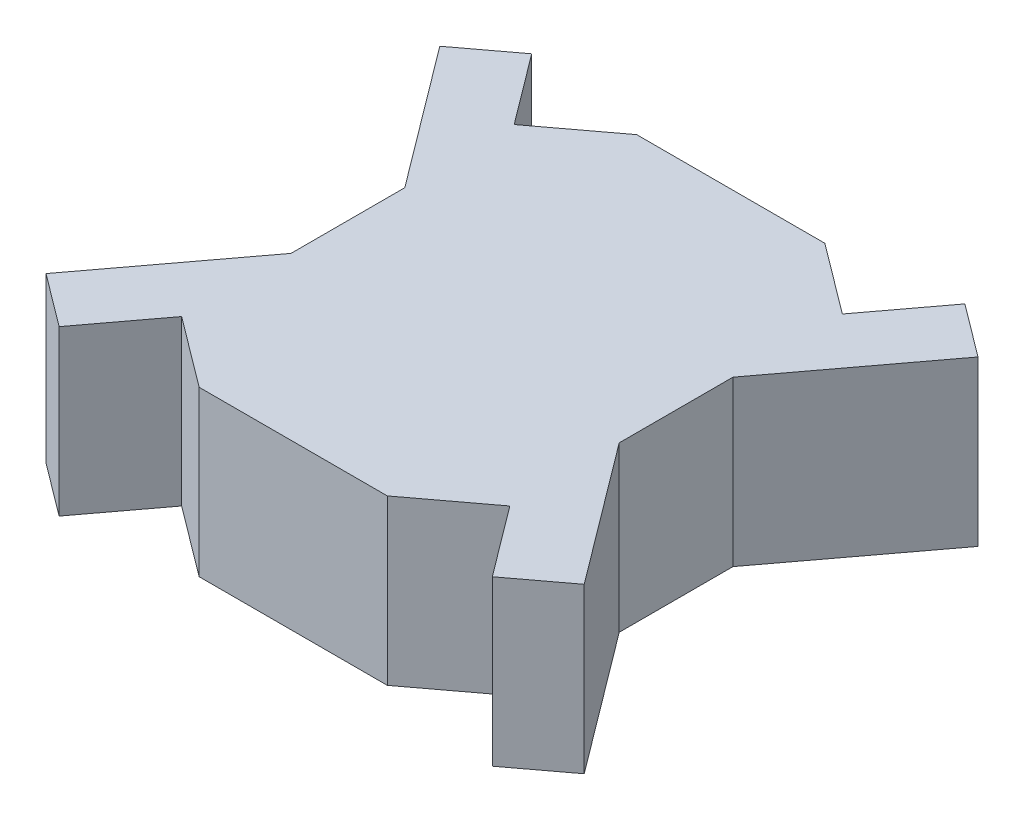
ISO-10303-21;
HEADER;
FILE_DESCRIPTION(('STEP AP214'),'2;1');
FILE_NAME('part.step','',(''),(''),'','','');
FILE_SCHEMA(('AUTOMOTIVE_DESIGN { 1 0 10303 214 1 1 1 1 }'));
ENDSEC;
DATA;
#1=APPLICATION_CONTEXT('core data for automotive mechanical design processes');
#2=APPLICATION_PROTOCOL_DEFINITION('international standard','automotive_design',2000,#1);
#3=PRODUCT_CONTEXT('',#1,'mechanical');
#4=PRODUCT('Part','Part','',(#3));
#5=PRODUCT_RELATED_PRODUCT_CATEGORY('part','',(#4));
#6=PRODUCT_DEFINITION_FORMATION('','',#4);
#7=PRODUCT_DEFINITION_CONTEXT('part definition',#1,'design');
#8=PRODUCT_DEFINITION('design','',#6,#7);
#9=PRODUCT_DEFINITION_SHAPE('','',#8);
#10=(LENGTH_UNIT() NAMED_UNIT(*) SI_UNIT(.MILLI.,.METRE.));
#11=(NAMED_UNIT(*) PLANE_ANGLE_UNIT() SI_UNIT($,.RADIAN.));
#12=(NAMED_UNIT(*) SI_UNIT($,.STERADIAN.) SOLID_ANGLE_UNIT());
#13=UNCERTAINTY_MEASURE_WITH_UNIT(LENGTH_MEASURE(1.E-05),#10,'distance_accuracy_value','');
#14=(GEOMETRIC_REPRESENTATION_CONTEXT(3) GLOBAL_UNCERTAINTY_ASSIGNED_CONTEXT((#13)) GLOBAL_UNIT_ASSIGNED_CONTEXT((#10,
#11,#12)) REPRESENTATION_CONTEXT('',''));
#15=CARTESIAN_POINT('',(0.,0.,0.));
#16=DIRECTION('',(0.,0.,1.));
#17=DIRECTION('',(1.,0.,0.));
#18=AXIS2_PLACEMENT_3D('',#15,#16,#17);
#19=CARTESIAN_POINT('',(43.,75.,-100.));
#20=DIRECTION('',(0.6,0.,-0.8));
#21=DIRECTION('',(-0.8,0.,-0.6));
#22=AXIS2_PLACEMENT_3D('',#19,#20,#21);
#23=PLANE('',#22);
#24=DIRECTION('',(0.8,0.,0.6));
#25=VECTOR('',#24,1.);
#26=CARTESIAN_POINT('',(43.,0.,-100.));
#27=LINE('',#26,#25);
#28=CARTESIAN_POINT('',(43.,0.,-100.));
#29=VERTEX_POINT('',#28);
#30=CARTESIAN_POINT('',(75.,0.,-76.));
#31=VERTEX_POINT('',#30);
#32=EDGE_CURVE('E207',#29,#31,#27,.T.);
#33=ORIENTED_EDGE('',*,*,#32,.F.);
#34=DIRECTION('',(0.,-1.,0.));
#35=VECTOR('',#34,1.);
#36=CARTESIAN_POINT('',(43.,75.,-100.));
#37=LINE('',#36,#35);
#38=CARTESIAN_POINT('',(43.,75.,-100.));
#39=VERTEX_POINT('',#38);
#40=EDGE_CURVE('E11',#39,#29,#37,.T.);
#41=ORIENTED_EDGE('',*,*,#40,.F.);
#42=DIRECTION('',(0.8,0.,0.6));
#43=VECTOR('',#42,1.);
#44=CARTESIAN_POINT('',(43.,75.,-100.));
#45=LINE('',#44,#43);
#46=CARTESIAN_POINT('',(75.,75.,-76.));
#47=VERTEX_POINT('',#46);
#48=EDGE_CURVE('E256',#39,#47,#45,.T.);
#49=ORIENTED_EDGE('',*,*,#48,.T.);
#50=DIRECTION('',(0.,-1.,0.));
#51=VECTOR('',#50,1.);
#52=CARTESIAN_POINT('',(75.,75.,-76.));
#53=LINE('',#52,#51);
#54=EDGE_CURVE('E40',#47,#31,#53,.T.);
#55=ORIENTED_EDGE('',*,*,#54,.T.);
#56=EDGE_LOOP('',(#33,#41,#49,#55));
#57=FACE_BOUND('',#56,.T.);
#58=ADVANCED_FACE('F37',(#57),#23,.T.);
#59=CARTESIAN_POINT('',(43.,75.,-100.));
#60=DIRECTION('',(0.,0.,1.));
#61=DIRECTION('',(1.,0.,0.));
#62=AXIS2_PLACEMENT_3D('',#59,#60,#61);
#63=PLANE('',#62);
#64=DIRECTION('',(-1.,0.,0.));
#65=VECTOR('',#64,1.);
#66=CARTESIAN_POINT('',(43.,0.,-100.));
#67=LINE('',#66,#65);
#68=CARTESIAN_POINT('',(-43.,0.,-100.));
#69=VERTEX_POINT('',#68);
#70=EDGE_CURVE('E118',#29,#69,#67,.T.);
#71=ORIENTED_EDGE('',*,*,#70,.T.);
#72=DIRECTION('',(0.,-1.,0.));
#73=VECTOR('',#72,1.);
#74=CARTESIAN_POINT('',(-43.,75.,-100.));
#75=LINE('',#74,#73);
#76=CARTESIAN_POINT('',(-43.,75.,-100.));
#77=VERTEX_POINT('',#76);
#78=EDGE_CURVE('E46',#77,#69,#75,.T.);
#79=ORIENTED_EDGE('',*,*,#78,.F.);
#80=DIRECTION('',(-1.,0.,0.));
#81=VECTOR('',#80,1.);
#82=CARTESIAN_POINT('',(43.,75.,-100.));
#83=LINE('',#82,#81);
#84=EDGE_CURVE('E185',#39,#77,#83,.T.);
#85=ORIENTED_EDGE('',*,*,#84,.F.);
#86=ORIENTED_EDGE('',*,*,#40,.T.);
#87=EDGE_LOOP('',(#71,#79,#85,#86));
#88=FACE_BOUND('',#87,.T.);
#89=ADVANCED_FACE('F408',(#88),#63,.F.);
#90=CARTESIAN_POINT('',(-43.,75.,-100.));
#91=DIRECTION('',(0.6,0.,0.8));
#92=DIRECTION('',(0.8,0.,-0.6));
#93=AXIS2_PLACEMENT_3D('',#90,#91,#92);
#94=PLANE('',#93);
#95=DIRECTION('',(-0.8,0.,0.6));
#96=VECTOR('',#95,1.);
#97=CARTESIAN_POINT('',(-43.,0.,-100.));
#98=LINE('',#97,#96);
#99=CARTESIAN_POINT('',(-75.,0.,-76.));
#100=VERTEX_POINT('',#99);
#101=EDGE_CURVE('E192',#69,#100,#98,.T.);
#102=ORIENTED_EDGE('',*,*,#101,.T.);
#103=DIRECTION('',(0.,-1.,0.));
#104=VECTOR('',#103,1.);
#105=CARTESIAN_POINT('',(-75.,75.,-76.));
#106=LINE('',#105,#104);
#107=CARTESIAN_POINT('',(-75.,75.,-76.));
#108=VERTEX_POINT('',#107);
#109=EDGE_CURVE('E189',#108,#100,#106,.T.);
#110=ORIENTED_EDGE('',*,*,#109,.F.);
#111=DIRECTION('',(-0.8,0.,0.6));
#112=VECTOR('',#111,1.);
#113=CARTESIAN_POINT('',(-43.,75.,-100.));
#114=LINE('',#113,#112);
#115=EDGE_CURVE('E178',#77,#108,#114,.T.);
#116=ORIENTED_EDGE('',*,*,#115,.F.);
#117=ORIENTED_EDGE('',*,*,#78,.T.);
#118=EDGE_LOOP('',(#102,#110,#116,#117));
#119=FACE_BOUND('',#118,.T.);
#120=ADVANCED_FACE('F190',(#119),#94,.F.);
#121=CARTESIAN_POINT('',(-75.,75.,-76.));
#122=DIRECTION('',(-0.8,0.,0.6));
#123=DIRECTION('',(0.6,0.,0.8));
#124=AXIS2_PLACEMENT_3D('',#121,#122,#123);
#125=PLANE('',#124);
#126=DIRECTION('',(-0.6,0.,-0.8));
#127=VECTOR('',#126,1.);
#128=CARTESIAN_POINT('',(-75.,0.,-76.));
#129=LINE('',#128,#127);
#130=CARTESIAN_POINT('',(-99.,0.,-108.));
#131=VERTEX_POINT('',#130);
#132=EDGE_CURVE('E253',#100,#131,#129,.T.);
#133=ORIENTED_EDGE('',*,*,#132,.T.);
#134=DIRECTION('',(0.,-1.,0.));
#135=VECTOR('',#134,1.);
#136=CARTESIAN_POINT('',(-99.,75.,-108.));
#137=LINE('',#136,#135);
#138=CARTESIAN_POINT('',(-99.,75.,-108.));
#139=VERTEX_POINT('',#138);
#140=EDGE_CURVE('E195',#139,#131,#137,.T.);
#141=ORIENTED_EDGE('',*,*,#140,.F.);
#142=DIRECTION('',(-0.6,0.,-0.8));
#143=VECTOR('',#142,1.);
#144=CARTESIAN_POINT('',(-75.,75.,-76.));
#145=LINE('',#144,#143);
#146=EDGE_CURVE('E183',#108,#139,#145,.T.);
#147=ORIENTED_EDGE('',*,*,#146,.F.);
#148=ORIENTED_EDGE('',*,*,#109,.T.);
#149=EDGE_LOOP('',(#133,#141,#147,#148));
#150=FACE_BOUND('',#149,.T.);
#151=ADVANCED_FACE('F197',(#150),#125,.F.);
#152=CARTESIAN_POINT('',(-99.,75.,-108.));
#153=DIRECTION('',(0.6,0.,0.8));
#154=DIRECTION('',(0.8,0.,-0.6));
#155=AXIS2_PLACEMENT_3D('',#152,#153,#154);
#156=PLANE('',#155);
#157=DIRECTION('',(-0.8,0.,0.6));
#158=VECTOR('',#157,1.);
#159=CARTESIAN_POINT('',(-99.,0.,-108.));
#160=LINE('',#159,#158);
#161=CARTESIAN_POINT('',(-123.,0.,-90.));
#162=VERTEX_POINT('',#161);
#163=EDGE_CURVE('E251',#131,#162,#160,.T.);
#164=ORIENTED_EDGE('',*,*,#163,.T.);
#165=DIRECTION('',(0.,-1.,0.));
#166=VECTOR('',#165,1.);
#167=CARTESIAN_POINT('',(-123.,75.,-90.));
#168=LINE('',#167,#166);
#169=CARTESIAN_POINT('',(-123.,75.,-90.));
#170=VERTEX_POINT('',#169);
#171=EDGE_CURVE('E260',#170,#162,#168,.T.);
#172=ORIENTED_EDGE('',*,*,#171,.F.);
#173=DIRECTION('',(-0.8,0.,0.6));
#174=VECTOR('',#173,1.);
#175=CARTESIAN_POINT('',(-99.,75.,-108.));
#176=LINE('',#175,#174);
#177=EDGE_CURVE('E200',#139,#170,#176,.T.);
#178=ORIENTED_EDGE('',*,*,#177,.F.);
#179=ORIENTED_EDGE('',*,*,#140,.T.);
#180=EDGE_LOOP('',(#164,#172,#178,#179));
#181=FACE_BOUND('',#180,.T.);
#182=ADVANCED_FACE('F300',(#181),#156,.F.);
#183=CARTESIAN_POINT('',(-123.,75.,-90.));
#184=DIRECTION('',(0.8,0.,-0.6));
#185=DIRECTION('',(-0.6,0.,-0.8));
#186=AXIS2_PLACEMENT_3D('',#183,#184,#185);
#187=PLANE('',#186);
#188=DIRECTION('',(0.6,0.,0.8));
#189=VECTOR('',#188,1.);
#190=CARTESIAN_POINT('',(-123.,0.,-90.));
#191=LINE('',#190,#189);
#192=CARTESIAN_POINT('',(-75.,0.,-26.));
#193=VERTEX_POINT('',#192);
#194=EDGE_CURVE('E249',#162,#193,#191,.T.);
#195=ORIENTED_EDGE('',*,*,#194,.T.);
#196=DIRECTION('',(0.,-1.,0.));
#197=VECTOR('',#196,1.);
#198=CARTESIAN_POINT('',(-75.,75.,-26.));
#199=LINE('',#198,#197);
#200=CARTESIAN_POINT('',(-75.,75.,-26.));
#201=VERTEX_POINT('',#200);
#202=EDGE_CURVE('E263',#201,#193,#199,.T.);
#203=ORIENTED_EDGE('',*,*,#202,.F.);
#204=DIRECTION('',(0.6,0.,0.8));
#205=VECTOR('',#204,1.);
#206=CARTESIAN_POINT('',(-123.,75.,-90.));
#207=LINE('',#206,#205);
#208=EDGE_CURVE('E202',#170,#201,#207,.T.);
#209=ORIENTED_EDGE('',*,*,#208,.F.);
#210=ORIENTED_EDGE('',*,*,#171,.T.);
#211=EDGE_LOOP('',(#195,#203,#209,#210));
#212=FACE_BOUND('',#211,.T.);
#213=ADVANCED_FACE('F309',(#212),#187,.F.);
#214=CARTESIAN_POINT('',(-75.,75.,-26.));
#215=DIRECTION('',(1.,0.,0.));
#216=DIRECTION('',(0.,0.,-1.));
#217=AXIS2_PLACEMENT_3D('',#214,#215,#216);
#218=PLANE('',#217);
#219=DIRECTION('',(0.,0.,1.));
#220=VECTOR('',#219,1.);
#221=CARTESIAN_POINT('',(-75.,0.,-26.));
#222=LINE('',#221,#220);
#223=CARTESIAN_POINT('',(-75.,0.,26.));
#224=VERTEX_POINT('',#223);
#225=EDGE_CURVE('E246',#193,#224,#222,.T.);
#226=ORIENTED_EDGE('',*,*,#225,.T.);
#227=DIRECTION('',(0.,-1.,0.));
#228=VECTOR('',#227,1.);
#229=CARTESIAN_POINT('',(-75.,75.,26.));
#230=LINE('',#229,#228);
#231=CARTESIAN_POINT('',(-75.,75.,26.));
#232=VERTEX_POINT('',#231);
#233=EDGE_CURVE('E266',#232,#224,#230,.T.);
#234=ORIENTED_EDGE('',*,*,#233,.F.);
#235=DIRECTION('',(0.,0.,1.));
#236=VECTOR('',#235,1.);
#237=CARTESIAN_POINT('',(-75.,75.,-26.));
#238=LINE('',#237,#236);
#239=EDGE_CURVE('E306',#201,#232,#238,.T.);
#240=ORIENTED_EDGE('',*,*,#239,.F.);
#241=ORIENTED_EDGE('',*,*,#202,.T.);
#242=EDGE_LOOP('',(#226,#234,#240,#241));
#243=FACE_BOUND('',#242,.T.);
#244=ADVANCED_FACE('F312',(#243),#218,.F.);
#245=CARTESIAN_POINT('',(-123.,75.,90.));
#246=DIRECTION('',(-0.8,0.,-0.6));
#247=DIRECTION('',(-0.6,0.,0.8));
#248=AXIS2_PLACEMENT_3D('',#245,#246,#247);
#249=PLANE('',#248);
#250=DIRECTION('',(0.6,0.,-0.8));
#251=VECTOR('',#250,1.);
#252=CARTESIAN_POINT('',(-123.,0.,90.));
#253=LINE('',#252,#251);
#254=CARTESIAN_POINT('',(-123.,0.,90.));
#255=VERTEX_POINT('',#254);
#256=EDGE_CURVE('E243',#255,#224,#253,.T.);
#257=ORIENTED_EDGE('',*,*,#256,.F.);
#258=DIRECTION('',(0.,-1.,0.));
#259=VECTOR('',#258,1.);
#260=CARTESIAN_POINT('',(-123.,75.,90.));
#261=LINE('',#260,#259);
#262=CARTESIAN_POINT('',(-123.,75.,90.));
#263=VERTEX_POINT('',#262);
#264=EDGE_CURVE('E268',#263,#255,#261,.T.);
#265=ORIENTED_EDGE('',*,*,#264,.F.);
#266=DIRECTION('',(0.6,0.,-0.8));
#267=VECTOR('',#266,1.);
#268=CARTESIAN_POINT('',(-123.,75.,90.));
#269=LINE('',#268,#267);
#270=EDGE_CURVE('E314',#263,#232,#269,.T.);
#271=ORIENTED_EDGE('',*,*,#270,.T.);
#272=ORIENTED_EDGE('',*,*,#233,.T.);
#273=EDGE_LOOP('',(#257,#265,#271,#272));
#274=FACE_BOUND('',#273,.T.);
#275=ADVANCED_FACE('F398',(#274),#249,.T.);
#276=CARTESIAN_POINT('',(-99.,75.,108.));
#277=DIRECTION('',(-0.6,0.,0.8));
#278=DIRECTION('',(0.8,0.,0.6));
#279=AXIS2_PLACEMENT_3D('',#276,#277,#278);
#280=PLANE('',#279);
#281=DIRECTION('',(-0.8,0.,-0.6));
#282=VECTOR('',#281,1.);
#283=CARTESIAN_POINT('',(-99.,0.,108.));
#284=LINE('',#283,#282);
#285=CARTESIAN_POINT('',(-99.,0.,108.));
#286=VERTEX_POINT('',#285);
#287=EDGE_CURVE('E240',#286,#255,#284,.T.);
#288=ORIENTED_EDGE('',*,*,#287,.F.);
#289=DIRECTION('',(0.,-1.,0.));
#290=VECTOR('',#289,1.);
#291=CARTESIAN_POINT('',(-99.,75.,108.));
#292=LINE('',#291,#290);
#293=CARTESIAN_POINT('',(-99.,75.,108.));
#294=VERTEX_POINT('',#293);
#295=EDGE_CURVE('E270',#294,#286,#292,.T.);
#296=ORIENTED_EDGE('',*,*,#295,.F.);
#297=DIRECTION('',(-0.8,0.,-0.6));
#298=VECTOR('',#297,1.);
#299=CARTESIAN_POINT('',(-99.,75.,108.));
#300=LINE('',#299,#298);
#301=EDGE_CURVE('E316',#294,#263,#300,.T.);
#302=ORIENTED_EDGE('',*,*,#301,.T.);
#303=ORIENTED_EDGE('',*,*,#264,.T.);
#304=EDGE_LOOP('',(#288,#296,#302,#303));
#305=FACE_BOUND('',#304,.T.);
#306=ADVANCED_FACE('F395',(#305),#280,.T.);
#307=CARTESIAN_POINT('',(-75.,75.,76.));
#308=DIRECTION('',(0.8,0.,0.6));
#309=DIRECTION('',(0.6,0.,-0.8));
#310=AXIS2_PLACEMENT_3D('',#307,#308,#309);
#311=PLANE('',#310);
#312=DIRECTION('',(-0.6,0.,0.8));
#313=VECTOR('',#312,1.);
#314=CARTESIAN_POINT('',(-75.,0.,76.));
#315=LINE('',#314,#313);
#316=CARTESIAN_POINT('',(-75.,0.,76.));
#317=VERTEX_POINT('',#316);
#318=EDGE_CURVE('E237',#317,#286,#315,.T.);
#319=ORIENTED_EDGE('',*,*,#318,.F.);
#320=DIRECTION('',(0.,-1.,0.));
#321=VECTOR('',#320,1.);
#322=CARTESIAN_POINT('',(-75.,75.,76.));
#323=LINE('',#322,#321);
#324=CARTESIAN_POINT('',(-75.,75.,76.));
#325=VERTEX_POINT('',#324);
#326=EDGE_CURVE('E272',#325,#317,#323,.T.);
#327=ORIENTED_EDGE('',*,*,#326,.F.);
#328=DIRECTION('',(-0.6,0.,0.8));
#329=VECTOR('',#328,1.);
#330=CARTESIAN_POINT('',(-75.,75.,76.));
#331=LINE('',#330,#329);
#332=EDGE_CURVE('E321',#325,#294,#331,.T.);
#333=ORIENTED_EDGE('',*,*,#332,.T.);
#334=ORIENTED_EDGE('',*,*,#295,.T.);
#335=EDGE_LOOP('',(#319,#327,#333,#334));
#336=FACE_BOUND('',#335,.T.);
#337=ADVANCED_FACE('F391',(#336),#311,.T.);
#338=CARTESIAN_POINT('',(-43.,75.,100.));
#339=DIRECTION('',(-0.6,0.,0.8));
#340=DIRECTION('',(0.8,0.,0.6));
#341=AXIS2_PLACEMENT_3D('',#338,#339,#340);
#342=PLANE('',#341);
#343=DIRECTION('',(-0.8,0.,-0.6));
#344=VECTOR('',#343,1.);
#345=CARTESIAN_POINT('',(-43.,0.,100.));
#346=LINE('',#345,#344);
#347=CARTESIAN_POINT('',(-43.,0.,100.));
#348=VERTEX_POINT('',#347);
#349=EDGE_CURVE('E234',#348,#317,#346,.T.);
#350=ORIENTED_EDGE('',*,*,#349,.F.);
#351=DIRECTION('',(0.,-1.,0.));
#352=VECTOR('',#351,1.);
#353=CARTESIAN_POINT('',(-43.,75.,100.));
#354=LINE('',#353,#352);
#355=CARTESIAN_POINT('',(-43.,75.,100.));
#356=VERTEX_POINT('',#355);
#357=EDGE_CURVE('E274',#356,#348,#354,.T.);
#358=ORIENTED_EDGE('',*,*,#357,.F.);
#359=DIRECTION('',(-0.8,0.,-0.6));
#360=VECTOR('',#359,1.);
#361=CARTESIAN_POINT('',(-43.,75.,100.));
#362=LINE('',#361,#360);
#363=EDGE_CURVE('E324',#356,#325,#362,.T.);
#364=ORIENTED_EDGE('',*,*,#363,.T.);
#365=ORIENTED_EDGE('',*,*,#326,.T.);
#366=EDGE_LOOP('',(#350,#358,#364,#365));
#367=FACE_BOUND('',#366,.T.);
#368=ADVANCED_FACE('F387',(#367),#342,.T.);
#369=CARTESIAN_POINT('',(43.,75.,100.));
#370=DIRECTION('',(0.,0.,1.));
#371=DIRECTION('',(1.,0.,0.));
#372=AXIS2_PLACEMENT_3D('',#369,#370,#371);
#373=PLANE('',#372);
#374=DIRECTION('',(-1.,0.,0.));
#375=VECTOR('',#374,1.);
#376=CARTESIAN_POINT('',(43.,0.,100.));
#377=LINE('',#376,#375);
#378=CARTESIAN_POINT('',(43.,0.,100.));
#379=VERTEX_POINT('',#378);
#380=EDGE_CURVE('E231',#379,#348,#377,.T.);
#381=ORIENTED_EDGE('',*,*,#380,.F.);
#382=DIRECTION('',(0.,-1.,0.));
#383=VECTOR('',#382,1.);
#384=CARTESIAN_POINT('',(43.,75.,100.));
#385=LINE('',#384,#383);
#386=CARTESIAN_POINT('',(43.,75.,100.));
#387=VERTEX_POINT('',#386);
#388=EDGE_CURVE('E276',#387,#379,#385,.T.);
#389=ORIENTED_EDGE('',*,*,#388,.F.);
#390=DIRECTION('',(-1.,0.,0.));
#391=VECTOR('',#390,1.);
#392=CARTESIAN_POINT('',(43.,75.,100.));
#393=LINE('',#392,#391);
#394=EDGE_CURVE('E327',#387,#356,#393,.T.);
#395=ORIENTED_EDGE('',*,*,#394,.T.);
#396=ORIENTED_EDGE('',*,*,#357,.T.);
#397=EDGE_LOOP('',(#381,#389,#395,#396));
#398=FACE_BOUND('',#397,.T.);
#399=ADVANCED_FACE('F383',(#398),#373,.T.);
#400=CARTESIAN_POINT('',(43.,75.,100.));
#401=DIRECTION('',(-0.6,0.,-0.8));
#402=DIRECTION('',(-0.8,0.,0.6));
#403=AXIS2_PLACEMENT_3D('',#400,#401,#402);
#404=PLANE('',#403);
#405=DIRECTION('',(0.8,0.,-0.6));
#406=VECTOR('',#405,1.);
#407=CARTESIAN_POINT('',(43.,0.,100.));
#408=LINE('',#407,#406);
#409=CARTESIAN_POINT('',(75.,0.,76.));
#410=VERTEX_POINT('',#409);
#411=EDGE_CURVE('E229',#379,#410,#408,.T.);
#412=ORIENTED_EDGE('',*,*,#411,.T.);
#413=DIRECTION('',(0.,-1.,0.));
#414=VECTOR('',#413,1.);
#415=CARTESIAN_POINT('',(75.,75.,76.));
#416=LINE('',#415,#414);
#417=CARTESIAN_POINT('',(75.,75.,76.));
#418=VERTEX_POINT('',#417);
#419=EDGE_CURVE('E278',#418,#410,#416,.T.);
#420=ORIENTED_EDGE('',*,*,#419,.F.);
#421=DIRECTION('',(0.8,0.,-0.6));
#422=VECTOR('',#421,1.);
#423=CARTESIAN_POINT('',(43.,75.,100.));
#424=LINE('',#423,#422);
#425=EDGE_CURVE('E330',#387,#418,#424,.T.);
#426=ORIENTED_EDGE('',*,*,#425,.F.);
#427=ORIENTED_EDGE('',*,*,#388,.T.);
#428=EDGE_LOOP('',(#412,#420,#426,#427));
#429=FACE_BOUND('',#428,.T.);
#430=ADVANCED_FACE('F379',(#429),#404,.F.);
#431=CARTESIAN_POINT('',(75.,75.,76.));
#432=DIRECTION('',(0.8,0.,-0.6));
#433=DIRECTION('',(-0.6,0.,-0.8));
#434=AXIS2_PLACEMENT_3D('',#431,#432,#433);
#435=PLANE('',#434);
#436=DIRECTION('',(0.6,0.,0.8));
#437=VECTOR('',#436,1.);
#438=CARTESIAN_POINT('',(75.,0.,76.));
#439=LINE('',#438,#437);
#440=CARTESIAN_POINT('',(99.,0.,108.));
#441=VERTEX_POINT('',#440);
#442=EDGE_CURVE('E227',#410,#441,#439,.T.);
#443=ORIENTED_EDGE('',*,*,#442,.T.);
#444=DIRECTION('',(0.,-1.,0.));
#445=VECTOR('',#444,1.);
#446=CARTESIAN_POINT('',(99.,75.,108.));
#447=LINE('',#446,#445);
#448=CARTESIAN_POINT('',(99.,75.,108.));
#449=VERTEX_POINT('',#448);
#450=EDGE_CURVE('E281',#449,#441,#447,.T.);
#451=ORIENTED_EDGE('',*,*,#450,.F.);
#452=DIRECTION('',(0.6,0.,0.8));
#453=VECTOR('',#452,1.);
#454=CARTESIAN_POINT('',(75.,75.,76.));
#455=LINE('',#454,#453);
#456=EDGE_CURVE('E332',#418,#449,#455,.T.);
#457=ORIENTED_EDGE('',*,*,#456,.F.);
#458=ORIENTED_EDGE('',*,*,#419,.T.);
#459=EDGE_LOOP('',(#443,#451,#457,#458));
#460=FACE_BOUND('',#459,.T.);
#461=ADVANCED_FACE('F375',(#460),#435,.F.);
#462=CARTESIAN_POINT('',(99.,75.,108.));
#463=DIRECTION('',(-0.6,0.,-0.8));
#464=DIRECTION('',(-0.8,0.,0.6));
#465=AXIS2_PLACEMENT_3D('',#462,#463,#464);
#466=PLANE('',#465);
#467=DIRECTION('',(0.8,0.,-0.6));
#468=VECTOR('',#467,1.);
#469=CARTESIAN_POINT('',(99.,0.,108.));
#470=LINE('',#469,#468);
#471=CARTESIAN_POINT('',(123.,0.,90.));
#472=VERTEX_POINT('',#471);
#473=EDGE_CURVE('E225',#441,#472,#470,.T.);
#474=ORIENTED_EDGE('',*,*,#473,.T.);
#475=DIRECTION('',(0.,-1.,0.));
#476=VECTOR('',#475,1.);
#477=CARTESIAN_POINT('',(123.,75.,90.));
#478=LINE('',#477,#476);
#479=CARTESIAN_POINT('',(123.,75.,90.));
#480=VERTEX_POINT('',#479);
#481=EDGE_CURVE('E284',#480,#472,#478,.T.);
#482=ORIENTED_EDGE('',*,*,#481,.F.);
#483=DIRECTION('',(0.8,0.,-0.6));
#484=VECTOR('',#483,1.);
#485=CARTESIAN_POINT('',(99.,75.,108.));
#486=LINE('',#485,#484);
#487=EDGE_CURVE('E334',#449,#480,#486,.T.);
#488=ORIENTED_EDGE('',*,*,#487,.F.);
#489=ORIENTED_EDGE('',*,*,#450,.T.);
#490=EDGE_LOOP('',(#474,#482,#488,#489));
#491=FACE_BOUND('',#490,.T.);
#492=ADVANCED_FACE('F370',(#491),#466,.F.);
#493=CARTESIAN_POINT('',(123.,75.,90.));
#494=DIRECTION('',(-0.8,0.,0.6));
#495=DIRECTION('',(0.6,0.,0.8));
#496=AXIS2_PLACEMENT_3D('',#493,#494,#495);
#497=PLANE('',#496);
#498=DIRECTION('',(-0.6,0.,-0.8));
#499=VECTOR('',#498,1.);
#500=CARTESIAN_POINT('',(123.,0.,90.));
#501=LINE('',#500,#499);
#502=CARTESIAN_POINT('',(75.,0.,26.));
#503=VERTEX_POINT('',#502);
#504=EDGE_CURVE('E222',#472,#503,#501,.T.);
#505=ORIENTED_EDGE('',*,*,#504,.T.);
#506=DIRECTION('',(0.,-1.,0.));
#507=VECTOR('',#506,1.);
#508=CARTESIAN_POINT('',(75.,75.,26.));
#509=LINE('',#508,#507);
#510=CARTESIAN_POINT('',(75.,75.,26.));
#511=VERTEX_POINT('',#510);
#512=EDGE_CURVE('E287',#511,#503,#509,.T.);
#513=ORIENTED_EDGE('',*,*,#512,.F.);
#514=DIRECTION('',(-0.6,0.,-0.8));
#515=VECTOR('',#514,1.);
#516=CARTESIAN_POINT('',(123.,75.,90.));
#517=LINE('',#516,#515);
#518=EDGE_CURVE('E336',#480,#511,#517,.T.);
#519=ORIENTED_EDGE('',*,*,#518,.F.);
#520=ORIENTED_EDGE('',*,*,#481,.T.);
#521=EDGE_LOOP('',(#505,#513,#519,#520));
#522=FACE_BOUND('',#521,.T.);
#523=ADVANCED_FACE('F364',(#522),#497,.F.);
#524=CARTESIAN_POINT('',(75.,75.,-26.));
#525=DIRECTION('',(1.,0.,0.));
#526=DIRECTION('',(0.,0.,-1.));
#527=AXIS2_PLACEMENT_3D('',#524,#525,#526);
#528=PLANE('',#527);
#529=DIRECTION('',(0.,0.,1.));
#530=VECTOR('',#529,1.);
#531=CARTESIAN_POINT('',(75.,0.,-26.));
#532=LINE('',#531,#530);
#533=CARTESIAN_POINT('',(75.,0.,-26.));
#534=VERTEX_POINT('',#533);
#535=EDGE_CURVE('E219',#534,#503,#532,.T.);
#536=ORIENTED_EDGE('',*,*,#535,.F.);
#537=DIRECTION('',(0.,-1.,0.));
#538=VECTOR('',#537,1.);
#539=CARTESIAN_POINT('',(75.,75.,-26.));
#540=LINE('',#539,#538);
#541=CARTESIAN_POINT('',(75.,75.,-26.));
#542=VERTEX_POINT('',#541);
#543=EDGE_CURVE('E289',#542,#534,#540,.T.);
#544=ORIENTED_EDGE('',*,*,#543,.F.);
#545=DIRECTION('',(0.,0.,1.));
#546=VECTOR('',#545,1.);
#547=CARTESIAN_POINT('',(75.,75.,-26.));
#548=LINE('',#547,#546);
#549=EDGE_CURVE('E338',#542,#511,#548,.T.);
#550=ORIENTED_EDGE('',*,*,#549,.T.);
#551=ORIENTED_EDGE('',*,*,#512,.T.);
#552=EDGE_LOOP('',(#536,#544,#550,#551));
#553=FACE_BOUND('',#552,.T.);
#554=ADVANCED_FACE('F360',(#553),#528,.T.);
#555=CARTESIAN_POINT('',(123.,75.,-90.));
#556=DIRECTION('',(0.8,0.,0.6));
#557=DIRECTION('',(0.6,0.,-0.8));
#558=AXIS2_PLACEMENT_3D('',#555,#556,#557);
#559=PLANE('',#558);
#560=DIRECTION('',(-0.6,0.,0.8));
#561=VECTOR('',#560,1.);
#562=CARTESIAN_POINT('',(123.,0.,-90.));
#563=LINE('',#562,#561);
#564=CARTESIAN_POINT('',(123.,0.,-90.));
#565=VERTEX_POINT('',#564);
#566=EDGE_CURVE('E216',#565,#534,#563,.T.);
#567=ORIENTED_EDGE('',*,*,#566,.F.);
#568=DIRECTION('',(0.,-1.,0.));
#569=VECTOR('',#568,1.);
#570=CARTESIAN_POINT('',(123.,75.,-90.));
#571=LINE('',#570,#569);
#572=CARTESIAN_POINT('',(123.,75.,-90.));
#573=VERTEX_POINT('',#572);
#574=EDGE_CURVE('E291',#573,#565,#571,.T.);
#575=ORIENTED_EDGE('',*,*,#574,.F.);
#576=DIRECTION('',(-0.6,0.,0.8));
#577=VECTOR('',#576,1.);
#578=CARTESIAN_POINT('',(123.,75.,-90.));
#579=LINE('',#578,#577);
#580=EDGE_CURVE('E341',#573,#542,#579,.T.);
#581=ORIENTED_EDGE('',*,*,#580,.T.);
#582=ORIENTED_EDGE('',*,*,#543,.T.);
#583=EDGE_LOOP('',(#567,#575,#581,#582));
#584=FACE_BOUND('',#583,.T.);
#585=ADVANCED_FACE('F358',(#584),#559,.T.);
#586=CARTESIAN_POINT('',(99.,75.,-108.));
#587=DIRECTION('',(0.6,0.,-0.8));
#588=DIRECTION('',(-0.8,0.,-0.6));
#589=AXIS2_PLACEMENT_3D('',#586,#587,#588);
#590=PLANE('',#589);
#591=DIRECTION('',(0.8,0.,0.6));
#592=VECTOR('',#591,1.);
#593=CARTESIAN_POINT('',(99.,0.,-108.));
#594=LINE('',#593,#592);
#595=CARTESIAN_POINT('',(99.,0.,-108.));
#596=VERTEX_POINT('',#595);
#597=EDGE_CURVE('E213',#596,#565,#594,.T.);
#598=ORIENTED_EDGE('',*,*,#597,.F.);
#599=DIRECTION('',(0.,-1.,0.));
#600=VECTOR('',#599,1.);
#601=CARTESIAN_POINT('',(99.,75.,-108.));
#602=LINE('',#601,#600);
#603=CARTESIAN_POINT('',(99.,75.,-108.));
#604=VERTEX_POINT('',#603);
#605=EDGE_CURVE('E292',#604,#596,#602,.T.);
#606=ORIENTED_EDGE('',*,*,#605,.F.);
#607=DIRECTION('',(0.8,0.,0.6));
#608=VECTOR('',#607,1.);
#609=CARTESIAN_POINT('',(99.,75.,-108.));
#610=LINE('',#609,#608);
#611=EDGE_CURVE('E344',#604,#573,#610,.T.);
#612=ORIENTED_EDGE('',*,*,#611,.T.);
#613=ORIENTED_EDGE('',*,*,#574,.T.);
#614=EDGE_LOOP('',(#598,#606,#612,#613));
#615=FACE_BOUND('',#614,.T.);
#616=ADVANCED_FACE('F353',(#615),#590,.T.);
#617=CARTESIAN_POINT('',(75.,75.,-76.));
#618=DIRECTION('',(-0.8,0.,-0.6));
#619=DIRECTION('',(-0.6,0.,0.8));
#620=AXIS2_PLACEMENT_3D('',#617,#618,#619);
#621=PLANE('',#620);
#622=DIRECTION('',(0.6,0.,-0.8));
#623=VECTOR('',#622,1.);
#624=CARTESIAN_POINT('',(75.,0.,-76.));
#625=LINE('',#624,#623);
#626=EDGE_CURVE('E210',#31,#596,#625,.T.);
#627=ORIENTED_EDGE('',*,*,#626,.F.);
#628=ORIENTED_EDGE('',*,*,#54,.F.);
#629=DIRECTION('',(0.6,0.,-0.8));
#630=VECTOR('',#629,1.);
#631=CARTESIAN_POINT('',(75.,75.,-76.));
#632=LINE('',#631,#630);
#633=EDGE_CURVE('E347',#47,#604,#632,.T.);
#634=ORIENTED_EDGE('',*,*,#633,.T.);
#635=ORIENTED_EDGE('',*,*,#605,.T.);
#636=EDGE_LOOP('',(#627,#628,#634,#635));
#637=FACE_BOUND('',#636,.T.);
#638=ADVANCED_FACE('F294',(#637),#621,.T.);
#639=CARTESIAN_POINT('',(0.,75.,0.));
#640=DIRECTION('',(0.,1.,0.));
#641=DIRECTION('',(0.,0.,1.));
#642=AXIS2_PLACEMENT_3D('',#639,#640,#641);
#643=PLANE('',#642);
#644=ORIENTED_EDGE('',*,*,#48,.F.);
#645=ORIENTED_EDGE('',*,*,#84,.T.);
#646=ORIENTED_EDGE('',*,*,#115,.T.);
#647=ORIENTED_EDGE('',*,*,#146,.T.);
#648=ORIENTED_EDGE('',*,*,#177,.T.);
#649=ORIENTED_EDGE('',*,*,#208,.T.);
#650=ORIENTED_EDGE('',*,*,#239,.T.);
#651=ORIENTED_EDGE('',*,*,#270,.F.);
#652=ORIENTED_EDGE('',*,*,#301,.F.);
#653=ORIENTED_EDGE('',*,*,#332,.F.);
#654=ORIENTED_EDGE('',*,*,#363,.F.);
#655=ORIENTED_EDGE('',*,*,#394,.F.);
#656=ORIENTED_EDGE('',*,*,#425,.T.);
#657=ORIENTED_EDGE('',*,*,#456,.T.);
#658=ORIENTED_EDGE('',*,*,#487,.T.);
#659=ORIENTED_EDGE('',*,*,#518,.T.);
#660=ORIENTED_EDGE('',*,*,#549,.F.);
#661=ORIENTED_EDGE('',*,*,#580,.F.);
#662=ORIENTED_EDGE('',*,*,#611,.F.);
#663=ORIENTED_EDGE('',*,*,#633,.F.);
#664=EDGE_LOOP('',(#644,#645,#646,#647,#648,#649,#650,#651,#652,#653,#654,#655,#656,#657,#658,
#659,#660,#661,#662,#663));
#665=FACE_BOUND('',#664,.T.);
#666=ADVANCED_FACE('F181',(#665),#643,.T.);
#667=CARTESIAN_POINT('',(0.,0.,0.));
#668=DIRECTION('',(0.,1.,0.));
#669=DIRECTION('',(0.,0.,1.));
#670=AXIS2_PLACEMENT_3D('',#667,#668,#669);
#671=PLANE('',#670);
#672=ORIENTED_EDGE('',*,*,#32,.T.);
#673=ORIENTED_EDGE('',*,*,#626,.T.);
#674=ORIENTED_EDGE('',*,*,#597,.T.);
#675=ORIENTED_EDGE('',*,*,#566,.T.);
#676=ORIENTED_EDGE('',*,*,#535,.T.);
#677=ORIENTED_EDGE('',*,*,#504,.F.);
#678=ORIENTED_EDGE('',*,*,#473,.F.);
#679=ORIENTED_EDGE('',*,*,#442,.F.);
#680=ORIENTED_EDGE('',*,*,#411,.F.);
#681=ORIENTED_EDGE('',*,*,#380,.T.);
#682=ORIENTED_EDGE('',*,*,#349,.T.);
#683=ORIENTED_EDGE('',*,*,#318,.T.);
#684=ORIENTED_EDGE('',*,*,#287,.T.);
#685=ORIENTED_EDGE('',*,*,#256,.T.);
#686=ORIENTED_EDGE('',*,*,#225,.F.);
#687=ORIENTED_EDGE('',*,*,#194,.F.);
#688=ORIENTED_EDGE('',*,*,#163,.F.);
#689=ORIENTED_EDGE('',*,*,#132,.F.);
#690=ORIENTED_EDGE('',*,*,#101,.F.);
#691=ORIENTED_EDGE('',*,*,#70,.F.);
#692=EDGE_LOOP('',(#672,#673,#674,#675,#676,#677,#678,#679,#680,#681,#682,#683,#684,#685,#686,
#687,#688,#689,#690,#691));
#693=FACE_BOUND('',#692,.T.);
#694=ADVANCED_FACE('F296',(#693),#671,.F.);
#695=CLOSED_SHELL('',(#58,#89,#120,#151,#182,#213,#244,#275,#306,#337,#368,#399,#430,#461,#492,
#523,#554,#585,#616,#638,#666,#694));
#696=MANIFOLD_SOLID_BREP('B2',#695);
#697=ADVANCED_BREP_SHAPE_REPRESENTATION('',(#18,#696),#14);
#698=SHAPE_DEFINITION_REPRESENTATION(#9,#697);
ENDSEC;
END-ISO-10303-21;
